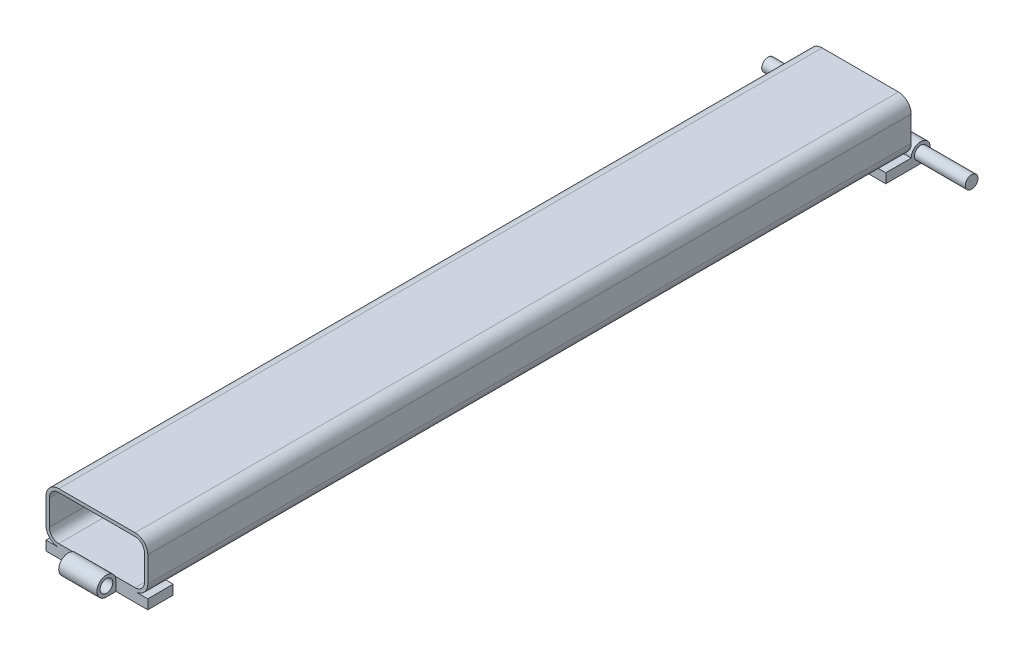
ISO-10303-21;
HEADER;
FILE_DESCRIPTION(('STEP AP214'),'2;1');
FILE_NAME('part.step','',(''),(''),'','','');
FILE_SCHEMA(('AUTOMOTIVE_DESIGN { 1 0 10303 214 1 1 1 1 }'));
ENDSEC;
DATA;
#1=APPLICATION_CONTEXT('core data for automotive mechanical design processes');
#2=APPLICATION_PROTOCOL_DEFINITION('international standard','automotive_design',2000,#1);
#3=PRODUCT_CONTEXT('',#1,'mechanical');
#4=PRODUCT('Part','Part','',(#3));
#5=PRODUCT_RELATED_PRODUCT_CATEGORY('part','',(#4));
#6=PRODUCT_DEFINITION_FORMATION('','',#4);
#7=PRODUCT_DEFINITION_CONTEXT('part definition',#1,'design');
#8=PRODUCT_DEFINITION('design','',#6,#7);
#9=PRODUCT_DEFINITION_SHAPE('','',#8);
#10=(LENGTH_UNIT() NAMED_UNIT(*) SI_UNIT(.MILLI.,.METRE.));
#11=(NAMED_UNIT(*) PLANE_ANGLE_UNIT() SI_UNIT($,.RADIAN.));
#12=(NAMED_UNIT(*) SI_UNIT($,.STERADIAN.) SOLID_ANGLE_UNIT());
#13=UNCERTAINTY_MEASURE_WITH_UNIT(LENGTH_MEASURE(1.E-05),#10,'distance_accuracy_value','');
#14=(GEOMETRIC_REPRESENTATION_CONTEXT(3) GLOBAL_UNCERTAINTY_ASSIGNED_CONTEXT((#13)) GLOBAL_UNIT_ASSIGNED_CONTEXT((#10,
#11,#12)) REPRESENTATION_CONTEXT('',''));
#15=CARTESIAN_POINT('',(0.,0.,0.));
#16=DIRECTION('',(0.,0.,1.));
#17=DIRECTION('',(1.,0.,0.));
#18=AXIS2_PLACEMENT_3D('',#15,#16,#17);
#19=CARTESIAN_POINT('',(-19.05,-12.7,190.5));
#20=DIRECTION('',(0.,1.,0.));
#21=DIRECTION('',(0.,0.,1.));
#22=AXIS2_PLACEMENT_3D('',#19,#20,#21);
#23=PLANE('',#22);
#24=DIRECTION('',(1.,0.,0.));
#25=VECTOR('',#24,1.);
#26=CARTESIAN_POINT('',(-25.4,-12.7,177.8));
#27=LINE('',#26,#25);
#28=CARTESIAN_POINT('',(-19.05,-12.7,177.8));
#29=VERTEX_POINT('',#28);
#30=CARTESIAN_POINT('',(19.05,-12.7,177.8));
#31=VERTEX_POINT('',#30);
#32=EDGE_CURVE('E57',#29,#31,#27,.T.);
#33=ORIENTED_EDGE('',*,*,#32,.F.);
#34=DIRECTION('',(0.,0.,-1.));
#35=VECTOR('',#34,1.);
#36=CARTESIAN_POINT('',(-19.05,-12.7,190.5));
#37=LINE('',#36,#35);
#38=CARTESIAN_POINT('',(-19.05,-12.7,-177.8));
#39=VERTEX_POINT('',#38);
#40=EDGE_CURVE('E430',#29,#39,#37,.T.);
#41=ORIENTED_EDGE('',*,*,#40,.T.);
#42=DIRECTION('',(1.,0.,0.));
#43=VECTOR('',#42,1.);
#44=CARTESIAN_POINT('',(-25.4,-12.7,-177.8));
#45=LINE('',#44,#43);
#46=CARTESIAN_POINT('',(19.05,-12.7,-177.8));
#47=VERTEX_POINT('',#46);
#48=EDGE_CURVE('E313',#39,#47,#45,.T.);
#49=ORIENTED_EDGE('',*,*,#48,.T.);
#50=DIRECTION('',(0.,0.,-1.));
#51=VECTOR('',#50,1.);
#52=CARTESIAN_POINT('',(19.05,-12.7,190.5));
#53=LINE('',#52,#51);
#54=EDGE_CURVE('E431',#31,#47,#53,.T.);
#55=ORIENTED_EDGE('',*,*,#54,.F.);
#56=EDGE_LOOP('',(#33,#41,#49,#55));
#57=FACE_BOUND('',#56,.T.);
#58=ADVANCED_FACE('F33',(#57),#23,.F.);
#59=CARTESIAN_POINT('',(-19.05,-6.35,190.5));
#60=DIRECTION('',(0.,0.,-1.));
#61=DIRECTION('',(-1.,0.,0.));
#62=AXIS2_PLACEMENT_3D('',#59,#60,#61);
#63=PLANE('',#62);
#64=CARTESIAN_POINT('',(-19.05,6.35,190.5));
#65=DIRECTION('',(0.,0.,1.));
#66=DIRECTION('',(-1.,0.,0.));
#67=AXIS2_PLACEMENT_3D('',#64,#65,#66);
#68=CIRCLE('',#67,4.699);
#69=CARTESIAN_POINT('',(-19.05,11.049,190.5));
#70=VERTEX_POINT('',#69);
#71=CARTESIAN_POINT('',(-23.749,6.35,190.5));
#72=VERTEX_POINT('',#71);
#73=EDGE_CURVE('E316',#70,#72,#68,.T.);
#74=ORIENTED_EDGE('',*,*,#73,.F.);
#75=DIRECTION('',(-1.,0.,0.));
#76=VECTOR('',#75,1.);
#77=CARTESIAN_POINT('',(-19.05,11.049,190.5));
#78=LINE('',#77,#76);
#79=CARTESIAN_POINT('',(19.05,11.049,190.5));
#80=VERTEX_POINT('',#79);
#81=EDGE_CURVE('E332',#80,#70,#78,.T.);
#82=ORIENTED_EDGE('',*,*,#81,.F.);
#83=CARTESIAN_POINT('',(19.05,6.35,190.5));
#84=DIRECTION('',(0.,0.,1.));
#85=DIRECTION('',(-1.,0.,0.));
#86=AXIS2_PLACEMENT_3D('',#83,#84,#85);
#87=CIRCLE('',#86,4.699);
#88=CARTESIAN_POINT('',(23.749,6.35,190.5));
#89=VERTEX_POINT('',#88);
#90=EDGE_CURVE('E329',#89,#80,#87,.T.);
#91=ORIENTED_EDGE('',*,*,#90,.F.);
#92=DIRECTION('',(0.,1.,0.));
#93=VECTOR('',#92,1.);
#94=CARTESIAN_POINT('',(23.749,-6.35,190.5));
#95=LINE('',#94,#93);
#96=CARTESIAN_POINT('',(23.749,-6.35,190.5));
#97=VERTEX_POINT('',#96);
#98=EDGE_CURVE('E327',#97,#89,#95,.T.);
#99=ORIENTED_EDGE('',*,*,#98,.F.);
#100=CARTESIAN_POINT('',(19.05,-6.35,190.5));
#101=DIRECTION('',(0.,0.,1.));
#102=DIRECTION('',(1.,0.,0.));
#103=AXIS2_PLACEMENT_3D('',#100,#101,#102);
#104=CIRCLE('',#103,4.699);
#105=CARTESIAN_POINT('',(19.05,-11.049,190.5));
#106=VERTEX_POINT('',#105);
#107=EDGE_CURVE('E325',#106,#97,#104,.T.);
#108=ORIENTED_EDGE('',*,*,#107,.F.);
#109=DIRECTION('',(1.,0.,0.));
#110=VECTOR('',#109,1.);
#111=CARTESIAN_POINT('',(-19.05,-11.049,190.5));
#112=LINE('',#111,#110);
#113=CARTESIAN_POINT('',(-19.05,-11.049,190.5));
#114=VERTEX_POINT('',#113);
#115=EDGE_CURVE('E323',#114,#106,#112,.T.);
#116=ORIENTED_EDGE('',*,*,#115,.F.);
#117=CARTESIAN_POINT('',(-19.05,-6.35,190.5));
#118=DIRECTION('',(0.,0.,1.));
#119=DIRECTION('',(-1.,0.,0.));
#120=AXIS2_PLACEMENT_3D('',#117,#118,#119);
#121=CIRCLE('',#120,4.699);
#122=CARTESIAN_POINT('',(-23.749,-6.35,190.5));
#123=VERTEX_POINT('',#122);
#124=EDGE_CURVE('E321',#123,#114,#121,.T.);
#125=ORIENTED_EDGE('',*,*,#124,.F.);
#126=DIRECTION('',(0.,-1.,0.));
#127=VECTOR('',#126,1.);
#128=CARTESIAN_POINT('',(-23.749,-6.35,190.5));
#129=LINE('',#128,#127);
#130=EDGE_CURVE('E318',#72,#123,#129,.T.);
#131=ORIENTED_EDGE('',*,*,#130,.F.);
#132=EDGE_LOOP('',(#74,#82,#91,#99,#108,#116,#125,#131));
#133=FACE_BOUND('',#132,.T.);
#134=DIRECTION('',(-1.,0.,0.));
#135=VECTOR('',#134,1.);
#136=CARTESIAN_POINT('',(-19.05,12.7,190.5));
#137=LINE('',#136,#135);
#138=CARTESIAN_POINT('',(19.05,12.7,190.5));
#139=VERTEX_POINT('',#138);
#140=CARTESIAN_POINT('',(-19.05,12.7,190.5));
#141=VERTEX_POINT('',#140);
#142=EDGE_CURVE('E387',#139,#141,#137,.T.);
#143=ORIENTED_EDGE('',*,*,#142,.T.);
#144=CARTESIAN_POINT('',(-19.05,6.35,190.5));
#145=DIRECTION('',(0.,0.,1.));
#146=DIRECTION('',(-1.,0.,0.));
#147=AXIS2_PLACEMENT_3D('',#144,#145,#146);
#148=CIRCLE('',#147,6.35);
#149=CARTESIAN_POINT('',(-25.4,6.35,190.5));
#150=VERTEX_POINT('',#149);
#151=EDGE_CURVE('E389',#141,#150,#148,.T.);
#152=ORIENTED_EDGE('',*,*,#151,.T.);
#153=DIRECTION('',(0.,-1.,0.));
#154=VECTOR('',#153,1.);
#155=CARTESIAN_POINT('',(-25.4,-6.35,190.5));
#156=LINE('',#155,#154);
#157=CARTESIAN_POINT('',(-25.4,-6.35,190.5));
#158=VERTEX_POINT('',#157);
#159=EDGE_CURVE('E391',#150,#158,#156,.T.);
#160=ORIENTED_EDGE('',*,*,#159,.T.);
#161=CARTESIAN_POINT('',(-19.05,-6.35,190.5));
#162=DIRECTION('',(0.,0.,1.));
#163=DIRECTION('',(-1.,0.,0.));
#164=AXIS2_PLACEMENT_3D('',#161,#162,#163);
#165=CIRCLE('',#164,6.35);
#166=CARTESIAN_POINT('',(-19.05,-12.7,190.5));
#167=VERTEX_POINT('',#166);
#168=EDGE_CURVE('E375',#158,#167,#165,.T.);
#169=ORIENTED_EDGE('',*,*,#168,.T.);
#170=DIRECTION('',(1.,0.,0.));
#171=VECTOR('',#170,1.);
#172=CARTESIAN_POINT('',(-25.4,-12.7,190.5));
#173=LINE('',#172,#171);
#174=CARTESIAN_POINT('',(-25.4,-12.7,190.5));
#175=VERTEX_POINT('',#174);
#176=EDGE_CURVE('E232',#175,#167,#173,.T.);
#177=ORIENTED_EDGE('',*,*,#176,.F.);
#178=DIRECTION('',(0.,1.,0.));
#179=VECTOR('',#178,1.);
#180=CARTESIAN_POINT('',(-25.4,-12.7,190.5));
#181=LINE('',#180,#179);
#182=CARTESIAN_POINT('',(-25.4,-17.4625000000001,190.5));
#183=VERTEX_POINT('',#182);
#184=EDGE_CURVE('E225',#183,#175,#181,.T.);
#185=ORIENTED_EDGE('',*,*,#184,.F.);
#186=DIRECTION('',(1.,0.,0.));
#187=VECTOR('',#186,1.);
#188=CARTESIAN_POINT('',(-9.525,-17.4625000000001,190.5));
#189=LINE('',#188,#187);
#190=CARTESIAN_POINT('',(-9.525,-17.4625000000001,190.5));
#191=VERTEX_POINT('',#190);
#192=EDGE_CURVE('E229',#183,#191,#189,.T.);
#193=ORIENTED_EDGE('',*,*,#192,.T.);
#194=DIRECTION('',(0.,-1.,0.));
#195=VECTOR('',#194,1.);
#196=CARTESIAN_POINT('',(-9.525,12.7,190.5));
#197=LINE('',#196,#195);
#198=CARTESIAN_POINT('',(-9.525,-12.7,190.5));
#199=VERTEX_POINT('',#198);
#200=EDGE_CURVE('E449',#199,#191,#197,.T.);
#201=ORIENTED_EDGE('',*,*,#200,.F.);
#202=DIRECTION('',(1.,0.,0.));
#203=VECTOR('',#202,1.);
#204=CARTESIAN_POINT('',(-19.05,-12.7,190.5));
#205=LINE('',#204,#203);
#206=CARTESIAN_POINT('',(9.525,-12.7,190.5));
#207=VERTEX_POINT('',#206);
#208=EDGE_CURVE('E377',#199,#207,#205,.T.);
#209=ORIENTED_EDGE('',*,*,#208,.T.);
#210=DIRECTION('',(0.,-1.,0.));
#211=VECTOR('',#210,1.);
#212=CARTESIAN_POINT('',(9.525,12.7,190.5));
#213=LINE('',#212,#211);
#214=CARTESIAN_POINT('',(9.525,-17.4625000000001,190.5));
#215=VERTEX_POINT('',#214);
#216=EDGE_CURVE('E246',#207,#215,#213,.T.);
#217=ORIENTED_EDGE('',*,*,#216,.T.);
#218=DIRECTION('',(1.,0.,0.));
#219=VECTOR('',#218,1.);
#220=CARTESIAN_POINT('',(25.4,-17.4625000000001,190.5));
#221=LINE('',#220,#219);
#222=CARTESIAN_POINT('',(25.4,-17.4625,190.5));
#223=VERTEX_POINT('',#222);
#224=EDGE_CURVE('E49',#215,#223,#221,.T.);
#225=ORIENTED_EDGE('',*,*,#224,.T.);
#226=DIRECTION('',(0.,1.,0.));
#227=VECTOR('',#226,1.);
#228=CARTESIAN_POINT('',(25.4,-12.7,190.5));
#229=LINE('',#228,#227);
#230=CARTESIAN_POINT('',(25.4,-12.7,190.5));
#231=VERTEX_POINT('',#230);
#232=EDGE_CURVE('E237',#223,#231,#229,.T.);
#233=ORIENTED_EDGE('',*,*,#232,.T.);
#234=CARTESIAN_POINT('',(19.05,-12.7,190.5));
#235=VERTEX_POINT('',#234);
#236=EDGE_CURVE('E253',#235,#231,#173,.T.);
#237=ORIENTED_EDGE('',*,*,#236,.F.);
#238=CARTESIAN_POINT('',(19.05,-6.35,190.5));
#239=DIRECTION('',(0.,0.,1.));
#240=DIRECTION('',(1.,0.,0.));
#241=AXIS2_PLACEMENT_3D('',#238,#239,#240);
#242=CIRCLE('',#241,6.35);
#243=CARTESIAN_POINT('',(25.4,-6.35,190.5));
#244=VERTEX_POINT('',#243);
#245=EDGE_CURVE('E381',#235,#244,#242,.T.);
#246=ORIENTED_EDGE('',*,*,#245,.T.);
#247=DIRECTION('',(0.,1.,0.));
#248=VECTOR('',#247,1.);
#249=CARTESIAN_POINT('',(25.4,-6.35,190.5));
#250=LINE('',#249,#248);
#251=CARTESIAN_POINT('',(25.4,6.35,190.5));
#252=VERTEX_POINT('',#251);
#253=EDGE_CURVE('E383',#244,#252,#250,.T.);
#254=ORIENTED_EDGE('',*,*,#253,.T.);
#255=CARTESIAN_POINT('',(19.05,6.35,190.5));
#256=DIRECTION('',(0.,0.,1.));
#257=DIRECTION('',(-1.,0.,0.));
#258=AXIS2_PLACEMENT_3D('',#255,#256,#257);
#259=CIRCLE('',#258,6.35);
#260=EDGE_CURVE('E385',#252,#139,#259,.T.);
#261=ORIENTED_EDGE('',*,*,#260,.T.);
#262=EDGE_LOOP('',(#143,#152,#160,#169,#177,#185,#193,#201,#209,#217,#225,#233,#237,#246,#254,#261));
#263=FACE_BOUND('',#262,.T.);
#264=ADVANCED_FACE('F227',(#133,#263),#63,.F.);
#265=CARTESIAN_POINT('',(-19.05,-6.35,-190.5));
#266=DIRECTION('',(0.,0.,-1.));
#267=DIRECTION('',(-1.,0.,0.));
#268=AXIS2_PLACEMENT_3D('',#265,#266,#267);
#269=PLANE('',#268);
#270=CARTESIAN_POINT('',(-19.05,-6.35,-190.5));
#271=DIRECTION('',(0.,0.,1.));
#272=DIRECTION('',(-1.,0.,0.));
#273=AXIS2_PLACEMENT_3D('',#270,#271,#272);
#274=CIRCLE('',#273,6.35);
#275=CARTESIAN_POINT('',(-25.4,-6.35,-190.5));
#276=VERTEX_POINT('',#275);
#277=CARTESIAN_POINT('',(-19.05,-12.7,-190.5));
#278=VERTEX_POINT('',#277);
#279=EDGE_CURVE('E374',#276,#278,#274,.T.);
#280=ORIENTED_EDGE('',*,*,#279,.F.);
#281=DIRECTION('',(0.,-1.,0.));
#282=VECTOR('',#281,1.);
#283=CARTESIAN_POINT('',(-25.4,-6.35,-190.5));
#284=LINE('',#283,#282);
#285=CARTESIAN_POINT('',(-25.4,6.35,-190.5));
#286=VERTEX_POINT('',#285);
#287=EDGE_CURVE('E378',#286,#276,#284,.T.);
#288=ORIENTED_EDGE('',*,*,#287,.F.);
#289=CARTESIAN_POINT('',(-19.05,6.35,-190.5));
#290=DIRECTION('',(0.,0.,1.));
#291=DIRECTION('',(-1.,0.,0.));
#292=AXIS2_PLACEMENT_3D('',#289,#290,#291);
#293=CIRCLE('',#292,6.35);
#294=CARTESIAN_POINT('',(-19.05,12.7,-190.5));
#295=VERTEX_POINT('',#294);
#296=EDGE_CURVE('E406',#295,#286,#293,.T.);
#297=ORIENTED_EDGE('',*,*,#296,.F.);
#298=DIRECTION('',(-1.,0.,0.));
#299=VECTOR('',#298,1.);
#300=CARTESIAN_POINT('',(-19.05,12.7,-190.5));
#301=LINE('',#300,#299);
#302=CARTESIAN_POINT('',(19.05,12.7,-190.5));
#303=VERTEX_POINT('',#302);
#304=EDGE_CURVE('E404',#303,#295,#301,.T.);
#305=ORIENTED_EDGE('',*,*,#304,.F.);
#306=CARTESIAN_POINT('',(19.05,6.35,-190.5));
#307=DIRECTION('',(0.,0.,1.));
#308=DIRECTION('',(-1.,0.,0.));
#309=AXIS2_PLACEMENT_3D('',#306,#307,#308);
#310=CIRCLE('',#309,6.35);
#311=CARTESIAN_POINT('',(25.4,6.35,-190.5));
#312=VERTEX_POINT('',#311);
#313=EDGE_CURVE('E402',#312,#303,#310,.T.);
#314=ORIENTED_EDGE('',*,*,#313,.F.);
#315=DIRECTION('',(0.,1.,0.));
#316=VECTOR('',#315,1.);
#317=CARTESIAN_POINT('',(25.4,-6.35,-190.5));
#318=LINE('',#317,#316);
#319=CARTESIAN_POINT('',(25.4,-6.35,-190.5));
#320=VERTEX_POINT('',#319);
#321=EDGE_CURVE('E400',#320,#312,#318,.T.);
#322=ORIENTED_EDGE('',*,*,#321,.F.);
#323=CARTESIAN_POINT('',(19.05,-6.35,-190.5));
#324=DIRECTION('',(0.,0.,1.));
#325=DIRECTION('',(1.,0.,0.));
#326=AXIS2_PLACEMENT_3D('',#323,#324,#325);
#327=CIRCLE('',#326,6.35);
#328=CARTESIAN_POINT('',(19.05,-12.7,-190.5));
#329=VERTEX_POINT('',#328);
#330=EDGE_CURVE('E398',#329,#320,#327,.T.);
#331=ORIENTED_EDGE('',*,*,#330,.F.);
#332=DIRECTION('',(1.,0.,0.));
#333=VECTOR('',#332,1.);
#334=CARTESIAN_POINT('',(-19.05,-12.7,-190.5));
#335=LINE('',#334,#333);
#336=EDGE_CURVE('E396',#278,#329,#335,.T.);
#337=ORIENTED_EDGE('',*,*,#336,.F.);
#338=EDGE_LOOP('',(#280,#288,#297,#305,#314,#322,#331,#337));
#339=FACE_BOUND('',#338,.T.);
#340=DIRECTION('',(-1.,0.,0.));
#341=VECTOR('',#340,1.);
#342=CARTESIAN_POINT('',(-19.05,11.049,-190.5));
#343=LINE('',#342,#341);
#344=CARTESIAN_POINT('',(19.05,11.049,-190.5));
#345=VERTEX_POINT('',#344);
#346=CARTESIAN_POINT('',(-19.05,11.049,-190.5));
#347=VERTEX_POINT('',#346);
#348=EDGE_CURVE('E319',#345,#347,#343,.T.);
#349=ORIENTED_EDGE('',*,*,#348,.T.);
#350=CARTESIAN_POINT('',(-19.05,6.35,-190.5));
#351=DIRECTION('',(0.,0.,1.));
#352=DIRECTION('',(-1.,0.,0.));
#353=AXIS2_PLACEMENT_3D('',#350,#351,#352);
#354=CIRCLE('',#353,4.699);
#355=CARTESIAN_POINT('',(-23.749,6.35,-190.5));
#356=VERTEX_POINT('',#355);
#357=EDGE_CURVE('E315',#347,#356,#354,.T.);
#358=ORIENTED_EDGE('',*,*,#357,.T.);
#359=DIRECTION('',(0.,-1.,0.));
#360=VECTOR('',#359,1.);
#361=CARTESIAN_POINT('',(-23.749,-6.35,-190.5));
#362=LINE('',#361,#360);
#363=CARTESIAN_POINT('',(-23.749,-6.35,-190.5));
#364=VERTEX_POINT('',#363);
#365=EDGE_CURVE('E337',#356,#364,#362,.T.);
#366=ORIENTED_EDGE('',*,*,#365,.T.);
#367=CARTESIAN_POINT('',(-19.05,-6.35,-190.5));
#368=DIRECTION('',(0.,0.,1.));
#369=DIRECTION('',(-1.,0.,0.));
#370=AXIS2_PLACEMENT_3D('',#367,#368,#369);
#371=CIRCLE('',#370,4.699);
#372=CARTESIAN_POINT('',(-19.05,-11.049,-190.5));
#373=VERTEX_POINT('',#372);
#374=EDGE_CURVE('E340',#364,#373,#371,.T.);
#375=ORIENTED_EDGE('',*,*,#374,.T.);
#376=DIRECTION('',(1.,0.,0.));
#377=VECTOR('',#376,1.);
#378=CARTESIAN_POINT('',(-19.05,-11.049,-190.5));
#379=LINE('',#378,#377);
#380=CARTESIAN_POINT('',(19.05,-11.049,-190.5));
#381=VERTEX_POINT('',#380);
#382=EDGE_CURVE('E343',#373,#381,#379,.T.);
#383=ORIENTED_EDGE('',*,*,#382,.T.);
#384=CARTESIAN_POINT('',(19.05,-6.35,-190.5));
#385=DIRECTION('',(0.,0.,1.));
#386=DIRECTION('',(1.,0.,0.));
#387=AXIS2_PLACEMENT_3D('',#384,#385,#386);
#388=CIRCLE('',#387,4.699);
#389=CARTESIAN_POINT('',(23.749,-6.35,-190.5));
#390=VERTEX_POINT('',#389);
#391=EDGE_CURVE('E346',#381,#390,#388,.T.);
#392=ORIENTED_EDGE('',*,*,#391,.T.);
#393=DIRECTION('',(0.,1.,0.));
#394=VECTOR('',#393,1.);
#395=CARTESIAN_POINT('',(23.749,-6.35,-190.5));
#396=LINE('',#395,#394);
#397=CARTESIAN_POINT('',(23.749,6.35,-190.5));
#398=VERTEX_POINT('',#397);
#399=EDGE_CURVE('E349',#390,#398,#396,.T.);
#400=ORIENTED_EDGE('',*,*,#399,.T.);
#401=CARTESIAN_POINT('',(19.05,6.35,-190.5));
#402=DIRECTION('',(0.,0.,1.));
#403=DIRECTION('',(-1.,0.,0.));
#404=AXIS2_PLACEMENT_3D('',#401,#402,#403);
#405=CIRCLE('',#404,4.699);
#406=EDGE_CURVE('E352',#398,#345,#405,.T.);
#407=ORIENTED_EDGE('',*,*,#406,.T.);
#408=EDGE_LOOP('',(#349,#358,#366,#375,#383,#392,#400,#407));
#409=FACE_BOUND('',#408,.T.);
#410=ADVANCED_FACE('F498',(#339,#409),#269,.T.);
#411=CARTESIAN_POINT('',(-19.05,-6.35,190.5));
#412=DIRECTION('',(0.,0.,-1.));
#413=DIRECTION('',(-1.,0.,0.));
#414=AXIS2_PLACEMENT_3D('',#411,#412,#413);
#415=CYLINDRICAL_SURFACE('',#414,6.35);
#416=ORIENTED_EDGE('',*,*,#279,.T.);
#417=DIRECTION('',(0.,0.,-1.));
#418=VECTOR('',#417,1.);
#419=CARTESIAN_POINT('',(-19.05,-12.7,190.5));
#420=LINE('',#419,#418);
#421=EDGE_CURVE('E304',#39,#278,#420,.T.);
#422=ORIENTED_EDGE('',*,*,#421,.F.);
#423=ORIENTED_EDGE('',*,*,#40,.F.);
#424=EDGE_CURVE('E432',#167,#29,#37,.T.);
#425=ORIENTED_EDGE('',*,*,#424,.F.);
#426=ORIENTED_EDGE('',*,*,#168,.F.);
#427=DIRECTION('',(0.,0.,-1.));
#428=VECTOR('',#427,1.);
#429=CARTESIAN_POINT('',(-25.4,-6.35,190.5));
#430=LINE('',#429,#428);
#431=EDGE_CURVE('E393',#158,#276,#430,.T.);
#432=ORIENTED_EDGE('',*,*,#431,.T.);
#433=EDGE_LOOP('',(#416,#422,#423,#425,#426,#432));
#434=FACE_BOUND('',#433,.T.);
#435=ADVANCED_FACE('F35',(#434),#415,.T.);
#436=CARTESIAN_POINT('',(19.05,-6.35,190.5));
#437=DIRECTION('',(0.,0.,-1.));
#438=DIRECTION('',(-1.,0.,0.));
#439=AXIS2_PLACEMENT_3D('',#436,#437,#438);
#440=CYLINDRICAL_SURFACE('',#439,6.35);
#441=ORIENTED_EDGE('',*,*,#330,.T.);
#442=DIRECTION('',(0.,0.,-1.));
#443=VECTOR('',#442,1.);
#444=CARTESIAN_POINT('',(25.4,-6.35,190.5));
#445=LINE('',#444,#443);
#446=EDGE_CURVE('E423',#244,#320,#445,.T.);
#447=ORIENTED_EDGE('',*,*,#446,.F.);
#448=ORIENTED_EDGE('',*,*,#245,.F.);
#449=EDGE_CURVE('E427',#235,#31,#53,.T.);
#450=ORIENTED_EDGE('',*,*,#449,.T.);
#451=ORIENTED_EDGE('',*,*,#54,.T.);
#452=EDGE_CURVE('E426',#47,#329,#53,.T.);
#453=ORIENTED_EDGE('',*,*,#452,.T.);
#454=EDGE_LOOP('',(#441,#447,#448,#450,#451,#453));
#455=FACE_BOUND('',#454,.T.);
#456=ADVANCED_FACE('F510',(#455),#440,.T.);
#457=CARTESIAN_POINT('',(25.4,-6.35,190.5));
#458=DIRECTION('',(-1.,0.,0.));
#459=DIRECTION('',(0.,0.,1.));
#460=AXIS2_PLACEMENT_3D('',#457,#458,#459);
#461=PLANE('',#460);
#462=ORIENTED_EDGE('',*,*,#321,.T.);
#463=DIRECTION('',(0.,0.,-1.));
#464=VECTOR('',#463,1.);
#465=CARTESIAN_POINT('',(25.4,6.35,190.5));
#466=LINE('',#465,#464);
#467=EDGE_CURVE('E420',#252,#312,#466,.T.);
#468=ORIENTED_EDGE('',*,*,#467,.F.);
#469=ORIENTED_EDGE('',*,*,#253,.F.);
#470=ORIENTED_EDGE('',*,*,#446,.T.);
#471=EDGE_LOOP('',(#462,#468,#469,#470));
#472=FACE_BOUND('',#471,.T.);
#473=ADVANCED_FACE('F537',(#472),#461,.F.);
#474=CARTESIAN_POINT('',(19.05,6.35,190.5));
#475=DIRECTION('',(0.,0.,-1.));
#476=DIRECTION('',(-1.,0.,0.));
#477=AXIS2_PLACEMENT_3D('',#474,#475,#476);
#478=CYLINDRICAL_SURFACE('',#477,6.35);
#479=ORIENTED_EDGE('',*,*,#313,.T.);
#480=DIRECTION('',(0.,0.,-1.));
#481=VECTOR('',#480,1.);
#482=CARTESIAN_POINT('',(19.05,12.7,190.5));
#483=LINE('',#482,#481);
#484=EDGE_CURVE('E417',#139,#303,#483,.T.);
#485=ORIENTED_EDGE('',*,*,#484,.F.);
#486=ORIENTED_EDGE('',*,*,#260,.F.);
#487=ORIENTED_EDGE('',*,*,#467,.T.);
#488=EDGE_LOOP('',(#479,#485,#486,#487));
#489=FACE_BOUND('',#488,.T.);
#490=ADVANCED_FACE('F540',(#489),#478,.T.);
#491=CARTESIAN_POINT('',(-19.05,12.7,190.5));
#492=DIRECTION('',(0.,-1.,0.));
#493=DIRECTION('',(0.,0.,-1.));
#494=AXIS2_PLACEMENT_3D('',#491,#492,#493);
#495=PLANE('',#494);
#496=ORIENTED_EDGE('',*,*,#304,.T.);
#497=DIRECTION('',(0.,0.,-1.));
#498=VECTOR('',#497,1.);
#499=CARTESIAN_POINT('',(-19.05,12.7,190.5));
#500=LINE('',#499,#498);
#501=EDGE_CURVE('E414',#141,#295,#500,.T.);
#502=ORIENTED_EDGE('',*,*,#501,.F.);
#503=ORIENTED_EDGE('',*,*,#142,.F.);
#504=ORIENTED_EDGE('',*,*,#484,.T.);
#505=EDGE_LOOP('',(#496,#502,#503,#504));
#506=FACE_BOUND('',#505,.T.);
#507=ADVANCED_FACE('F544',(#506),#495,.F.);
#508=CARTESIAN_POINT('',(-19.05,6.35,190.5));
#509=DIRECTION('',(0.,0.,-1.));
#510=DIRECTION('',(-1.,0.,0.));
#511=AXIS2_PLACEMENT_3D('',#508,#509,#510);
#512=CYLINDRICAL_SURFACE('',#511,6.35);
#513=ORIENTED_EDGE('',*,*,#296,.T.);
#514=DIRECTION('',(0.,0.,-1.));
#515=VECTOR('',#514,1.);
#516=CARTESIAN_POINT('',(-25.4,6.35,190.5));
#517=LINE('',#516,#515);
#518=EDGE_CURVE('E411',#150,#286,#517,.T.);
#519=ORIENTED_EDGE('',*,*,#518,.F.);
#520=ORIENTED_EDGE('',*,*,#151,.F.);
#521=ORIENTED_EDGE('',*,*,#501,.T.);
#522=EDGE_LOOP('',(#513,#519,#520,#521));
#523=FACE_BOUND('',#522,.T.);
#524=ADVANCED_FACE('F548',(#523),#512,.T.);
#525=CARTESIAN_POINT('',(-25.4,-6.35,190.5));
#526=DIRECTION('',(1.,0.,0.));
#527=DIRECTION('',(0.,0.,-1.));
#528=AXIS2_PLACEMENT_3D('',#525,#526,#527);
#529=PLANE('',#528);
#530=ORIENTED_EDGE('',*,*,#287,.T.);
#531=ORIENTED_EDGE('',*,*,#431,.F.);
#532=ORIENTED_EDGE('',*,*,#159,.F.);
#533=ORIENTED_EDGE('',*,*,#518,.T.);
#534=EDGE_LOOP('',(#530,#531,#532,#533));
#535=FACE_BOUND('',#534,.T.);
#536=ADVANCED_FACE('F552',(#535),#529,.F.);
#537=CARTESIAN_POINT('',(-19.05,6.35,190.5));
#538=DIRECTION('',(0.,0.,-1.));
#539=DIRECTION('',(-1.,0.,0.));
#540=AXIS2_PLACEMENT_3D('',#537,#538,#539);
#541=CYLINDRICAL_SURFACE('',#540,4.699);
#542=ORIENTED_EDGE('',*,*,#357,.F.);
#543=DIRECTION('',(0.,0.,-1.));
#544=VECTOR('',#543,1.);
#545=CARTESIAN_POINT('',(-19.05,11.049,190.5));
#546=LINE('',#545,#544);
#547=EDGE_CURVE('E334',#70,#347,#546,.T.);
#548=ORIENTED_EDGE('',*,*,#547,.F.);
#549=ORIENTED_EDGE('',*,*,#73,.T.);
#550=DIRECTION('',(0.,0.,-1.));
#551=VECTOR('',#550,1.);
#552=CARTESIAN_POINT('',(-23.749,6.35,190.5));
#553=LINE('',#552,#551);
#554=EDGE_CURVE('E371',#72,#356,#553,.T.);
#555=ORIENTED_EDGE('',*,*,#554,.T.);
#556=EDGE_LOOP('',(#542,#548,#549,#555));
#557=FACE_BOUND('',#556,.T.);
#558=ADVANCED_FACE('F556',(#557),#541,.F.);
#559=CARTESIAN_POINT('',(-23.749,-6.35,190.5));
#560=DIRECTION('',(1.,0.,0.));
#561=DIRECTION('',(0.,0.,-1.));
#562=AXIS2_PLACEMENT_3D('',#559,#560,#561);
#563=PLANE('',#562);
#564=ORIENTED_EDGE('',*,*,#365,.F.);
#565=ORIENTED_EDGE('',*,*,#554,.F.);
#566=ORIENTED_EDGE('',*,*,#130,.T.);
#567=DIRECTION('',(0.,0.,-1.));
#568=VECTOR('',#567,1.);
#569=CARTESIAN_POINT('',(-23.749,-6.35,190.5));
#570=LINE('',#569,#568);
#571=EDGE_CURVE('E369',#123,#364,#570,.T.);
#572=ORIENTED_EDGE('',*,*,#571,.T.);
#573=EDGE_LOOP('',(#564,#565,#566,#572));
#574=FACE_BOUND('',#573,.T.);
#575=ADVANCED_FACE('F562',(#574),#563,.T.);
#576=CARTESIAN_POINT('',(-19.05,-6.35,190.5));
#577=DIRECTION('',(0.,0.,-1.));
#578=DIRECTION('',(-1.,0.,0.));
#579=AXIS2_PLACEMENT_3D('',#576,#577,#578);
#580=CYLINDRICAL_SURFACE('',#579,4.699);
#581=ORIENTED_EDGE('',*,*,#374,.F.);
#582=ORIENTED_EDGE('',*,*,#571,.F.);
#583=ORIENTED_EDGE('',*,*,#124,.T.);
#584=DIRECTION('',(0.,0.,-1.));
#585=VECTOR('',#584,1.);
#586=CARTESIAN_POINT('',(-19.05,-11.049,190.5));
#587=LINE('',#586,#585);
#588=EDGE_CURVE('E367',#114,#373,#587,.T.);
#589=ORIENTED_EDGE('',*,*,#588,.T.);
#590=EDGE_LOOP('',(#581,#582,#583,#589));
#591=FACE_BOUND('',#590,.T.);
#592=ADVANCED_FACE('F566',(#591),#580,.F.);
#593=CARTESIAN_POINT('',(-19.05,-11.049,190.5));
#594=DIRECTION('',(0.,1.,0.));
#595=DIRECTION('',(0.,0.,1.));
#596=AXIS2_PLACEMENT_3D('',#593,#594,#595);
#597=PLANE('',#596);
#598=ORIENTED_EDGE('',*,*,#382,.F.);
#599=ORIENTED_EDGE('',*,*,#588,.F.);
#600=ORIENTED_EDGE('',*,*,#115,.T.);
#601=DIRECTION('',(0.,0.,-1.));
#602=VECTOR('',#601,1.);
#603=CARTESIAN_POINT('',(19.05,-11.049,190.5));
#604=LINE('',#603,#602);
#605=EDGE_CURVE('E365',#106,#381,#604,.T.);
#606=ORIENTED_EDGE('',*,*,#605,.T.);
#607=EDGE_LOOP('',(#598,#599,#600,#606));
#608=FACE_BOUND('',#607,.T.);
#609=ADVANCED_FACE('F570',(#608),#597,.T.);
#610=CARTESIAN_POINT('',(19.05,-6.35,190.5));
#611=DIRECTION('',(0.,0.,-1.));
#612=DIRECTION('',(-1.,0.,0.));
#613=AXIS2_PLACEMENT_3D('',#610,#611,#612);
#614=CYLINDRICAL_SURFACE('',#613,4.699);
#615=ORIENTED_EDGE('',*,*,#391,.F.);
#616=ORIENTED_EDGE('',*,*,#605,.F.);
#617=ORIENTED_EDGE('',*,*,#107,.T.);
#618=DIRECTION('',(0.,0.,-1.));
#619=VECTOR('',#618,1.);
#620=CARTESIAN_POINT('',(23.749,-6.35,190.5));
#621=LINE('',#620,#619);
#622=EDGE_CURVE('E363',#97,#390,#621,.T.);
#623=ORIENTED_EDGE('',*,*,#622,.T.);
#624=EDGE_LOOP('',(#615,#616,#617,#623));
#625=FACE_BOUND('',#624,.T.);
#626=ADVANCED_FACE('F574',(#625),#614,.F.);
#627=CARTESIAN_POINT('',(23.749,-6.35,190.5));
#628=DIRECTION('',(-1.,0.,0.));
#629=DIRECTION('',(0.,-1.,0.));
#630=AXIS2_PLACEMENT_3D('',#627,#628,#629);
#631=PLANE('',#630);
#632=ORIENTED_EDGE('',*,*,#399,.F.);
#633=ORIENTED_EDGE('',*,*,#622,.F.);
#634=ORIENTED_EDGE('',*,*,#98,.T.);
#635=DIRECTION('',(0.,0.,-1.));
#636=VECTOR('',#635,1.);
#637=CARTESIAN_POINT('',(23.749,6.35,190.5));
#638=LINE('',#637,#636);
#639=EDGE_CURVE('E361',#89,#398,#638,.T.);
#640=ORIENTED_EDGE('',*,*,#639,.T.);
#641=EDGE_LOOP('',(#632,#633,#634,#640));
#642=FACE_BOUND('',#641,.T.);
#643=ADVANCED_FACE('F578',(#642),#631,.T.);
#644=CARTESIAN_POINT('',(19.05,6.35,190.5));
#645=DIRECTION('',(0.,0.,-1.));
#646=DIRECTION('',(-1.,0.,0.));
#647=AXIS2_PLACEMENT_3D('',#644,#645,#646);
#648=CYLINDRICAL_SURFACE('',#647,4.699);
#649=ORIENTED_EDGE('',*,*,#406,.F.);
#650=ORIENTED_EDGE('',*,*,#639,.F.);
#651=ORIENTED_EDGE('',*,*,#90,.T.);
#652=DIRECTION('',(0.,0.,-1.));
#653=VECTOR('',#652,1.);
#654=CARTESIAN_POINT('',(19.05,11.049,190.5));
#655=LINE('',#654,#653);
#656=EDGE_CURVE('E359',#80,#345,#655,.T.);
#657=ORIENTED_EDGE('',*,*,#656,.T.);
#658=EDGE_LOOP('',(#649,#650,#651,#657));
#659=FACE_BOUND('',#658,.T.);
#660=ADVANCED_FACE('F582',(#659),#648,.F.);
#661=CARTESIAN_POINT('',(-19.05,11.049,190.5));
#662=DIRECTION('',(0.,-1.,0.));
#663=DIRECTION('',(0.,0.,-1.));
#664=AXIS2_PLACEMENT_3D('',#661,#662,#663);
#665=PLANE('',#664);
#666=ORIENTED_EDGE('',*,*,#348,.F.);
#667=ORIENTED_EDGE('',*,*,#656,.F.);
#668=ORIENTED_EDGE('',*,*,#81,.T.);
#669=ORIENTED_EDGE('',*,*,#547,.T.);
#670=EDGE_LOOP('',(#666,#667,#668,#669));
#671=FACE_BOUND('',#670,.T.);
#672=ADVANCED_FACE('F586',(#671),#665,.T.);
#673=CARTESIAN_POINT('',(-25.4,-12.7,-190.5));
#674=DIRECTION('',(0.,1.,0.));
#675=DIRECTION('',(0.,0.,1.));
#676=AXIS2_PLACEMENT_3D('',#673,#674,#675);
#677=PLANE('',#676);
#678=ORIENTED_EDGE('',*,*,#452,.F.);
#679=CARTESIAN_POINT('',(25.4,-12.7,-177.8));
#680=VERTEX_POINT('',#679);
#681=EDGE_CURVE('E290',#47,#680,#45,.T.);
#682=ORIENTED_EDGE('',*,*,#681,.T.);
#683=DIRECTION('',(0.,0.,1.));
#684=VECTOR('',#683,1.);
#685=CARTESIAN_POINT('',(25.4,-12.7,-190.5));
#686=LINE('',#685,#684);
#687=CARTESIAN_POINT('',(25.4,-12.7,-190.5));
#688=VERTEX_POINT('',#687);
#689=EDGE_CURVE('E269',#688,#680,#686,.T.);
#690=ORIENTED_EDGE('',*,*,#689,.F.);
#691=DIRECTION('',(1.,0.,0.));
#692=VECTOR('',#691,1.);
#693=CARTESIAN_POINT('',(-25.4,-12.7,-190.5));
#694=LINE('',#693,#692);
#695=EDGE_CURVE('E305',#329,#688,#694,.T.);
#696=ORIENTED_EDGE('',*,*,#695,.F.);
#697=EDGE_LOOP('',(#678,#682,#690,#696));
#698=FACE_BOUND('',#697,.T.);
#699=ADVANCED_FACE('F508',(#698),#677,.T.);
#700=CARTESIAN_POINT('',(-25.4,-12.7,-177.8));
#701=VERTEX_POINT('',#700);
#702=EDGE_CURVE('E310',#701,#39,#45,.T.);
#703=ORIENTED_EDGE('',*,*,#702,.T.);
#704=ORIENTED_EDGE('',*,*,#421,.T.);
#705=CARTESIAN_POINT('',(-25.4,-12.7,-190.5));
#706=VERTEX_POINT('',#705);
#707=EDGE_CURVE('E301',#706,#278,#694,.T.);
#708=ORIENTED_EDGE('',*,*,#707,.F.);
#709=DIRECTION('',(0.,0.,1.));
#710=VECTOR('',#709,1.);
#711=CARTESIAN_POINT('',(-25.4,-12.7,-190.5));
#712=LINE('',#711,#710);
#713=EDGE_CURVE('E277',#706,#701,#712,.T.);
#714=ORIENTED_EDGE('',*,*,#713,.T.);
#715=EDGE_LOOP('',(#703,#704,#708,#714));
#716=FACE_BOUND('',#715,.T.);
#717=ADVANCED_FACE('F489',(#716),#677,.T.);
#718=CARTESIAN_POINT('',(-25.4,-12.7,-195.2625));
#719=DIRECTION('',(1.,0.,0.));
#720=DIRECTION('',(0.,0.,-1.));
#721=AXIS2_PLACEMENT_3D('',#718,#719,#720);
#722=CYLINDRICAL_SURFACE('',#721,4.7625);
#723=CARTESIAN_POINT('',(25.4,-12.7,-195.2625));
#724=DIRECTION('',(1.,0.,0.));
#725=DIRECTION('',(0.,0.,-1.));
#726=AXIS2_PLACEMENT_3D('',#723,#724,#725);
#727=CIRCLE('',#726,4.7625);
#728=CARTESIAN_POINT('',(25.4,-17.4625,-195.2625));
#729=VERTEX_POINT('',#728);
#730=EDGE_CURVE('E281',#729,#688,#727,.T.);
#731=ORIENTED_EDGE('',*,*,#730,.F.);
#732=DIRECTION('',(1.,0.,0.));
#733=VECTOR('',#732,1.);
#734=CARTESIAN_POINT('',(-25.4,-17.4625,-195.2625));
#735=LINE('',#734,#733);
#736=CARTESIAN_POINT('',(-25.4,-17.4625,-195.2625));
#737=VERTEX_POINT('',#736);
#738=EDGE_CURVE('E306',#737,#729,#735,.T.);
#739=ORIENTED_EDGE('',*,*,#738,.F.);
#740=CARTESIAN_POINT('',(-25.4,-12.7,-195.2625));
#741=DIRECTION('',(1.,0.,0.));
#742=DIRECTION('',(0.,0.,-1.));
#743=AXIS2_PLACEMENT_3D('',#740,#741,#742);
#744=CIRCLE('',#743,4.7625);
#745=EDGE_CURVE('E287',#737,#706,#744,.T.);
#746=ORIENTED_EDGE('',*,*,#745,.T.);
#747=ORIENTED_EDGE('',*,*,#707,.T.);
#748=ORIENTED_EDGE('',*,*,#336,.T.);
#749=ORIENTED_EDGE('',*,*,#695,.T.);
#750=EDGE_LOOP('',(#731,#739,#746,#747,#748,#749));
#751=FACE_BOUND('',#750,.T.);
#752=ADVANCED_FACE('F478',(#751),#722,.T.);
#753=CARTESIAN_POINT('',(-25.4,-17.4625,-177.8));
#754=DIRECTION('',(0.,-1.,0.));
#755=DIRECTION('',(0.,0.,-1.));
#756=AXIS2_PLACEMENT_3D('',#753,#754,#755);
#757=PLANE('',#756);
#758=DIRECTION('',(0.,0.,-1.));
#759=VECTOR('',#758,1.);
#760=CARTESIAN_POINT('',(25.4,-17.4625,-177.8));
#761=LINE('',#760,#759);
#762=CARTESIAN_POINT('',(25.4,-17.4625,-177.8));
#763=VERTEX_POINT('',#762);
#764=EDGE_CURVE('E296',#763,#729,#761,.T.);
#765=ORIENTED_EDGE('',*,*,#764,.F.);
#766=DIRECTION('',(1.,0.,0.));
#767=VECTOR('',#766,1.);
#768=CARTESIAN_POINT('',(-25.4,-17.4625,-177.8));
#769=LINE('',#768,#767);
#770=CARTESIAN_POINT('',(-25.4,-17.4625,-177.8));
#771=VERTEX_POINT('',#770);
#772=EDGE_CURVE('E308',#771,#763,#769,.T.);
#773=ORIENTED_EDGE('',*,*,#772,.F.);
#774=DIRECTION('',(0.,0.,-1.));
#775=VECTOR('',#774,1.);
#776=CARTESIAN_POINT('',(-25.4,-17.4625,-177.8));
#777=LINE('',#776,#775);
#778=EDGE_CURVE('E284',#771,#737,#777,.T.);
#779=ORIENTED_EDGE('',*,*,#778,.T.);
#780=ORIENTED_EDGE('',*,*,#738,.T.);
#781=EDGE_LOOP('',(#765,#773,#779,#780));
#782=FACE_BOUND('',#781,.T.);
#783=ADVANCED_FACE('F482',(#782),#757,.T.);
#784=CARTESIAN_POINT('',(-25.4,-12.7,-177.8));
#785=DIRECTION('',(0.,0.,1.));
#786=DIRECTION('',(1.,0.,0.));
#787=AXIS2_PLACEMENT_3D('',#784,#785,#786);
#788=PLANE('',#787);
#789=DIRECTION('',(0.,-1.,0.));
#790=VECTOR('',#789,1.);
#791=CARTESIAN_POINT('',(25.4,-12.7,-177.8));
#792=LINE('',#791,#790);
#793=EDGE_CURVE('E293',#680,#763,#792,.T.);
#794=ORIENTED_EDGE('',*,*,#793,.F.);
#795=ORIENTED_EDGE('',*,*,#681,.F.);
#796=ORIENTED_EDGE('',*,*,#48,.F.);
#797=ORIENTED_EDGE('',*,*,#702,.F.);
#798=DIRECTION('',(0.,-1.,0.));
#799=VECTOR('',#798,1.);
#800=CARTESIAN_POINT('',(-25.4,-12.7,-177.8));
#801=LINE('',#800,#799);
#802=EDGE_CURVE('E280',#701,#771,#801,.T.);
#803=ORIENTED_EDGE('',*,*,#802,.T.);
#804=ORIENTED_EDGE('',*,*,#772,.T.);
#805=EDGE_LOOP('',(#794,#795,#796,#797,#803,#804));
#806=FACE_BOUND('',#805,.T.);
#807=ADVANCED_FACE('F469',(#806),#788,.T.);
#808=CARTESIAN_POINT('',(-25.4,-12.7,-195.2625));
#809=DIRECTION('',(1.,0.,0.));
#810=DIRECTION('',(0.,0.,-1.));
#811=AXIS2_PLACEMENT_3D('',#808,#809,#810);
#812=PLANE('',#811);
#813=CARTESIAN_POINT('',(-25.4,-12.7,-195.2625));
#814=DIRECTION('',(1.,0.,0.));
#815=DIRECTION('',(0.,0.,-1.));
#816=AXIS2_PLACEMENT_3D('',#813,#814,#815);
#817=CIRCLE('',#816,3.175);
#818=CARTESIAN_POINT('',(-25.4,-12.7,-198.4375));
#819=VERTEX_POINT('',#818);
#820=EDGE_CURVE('E434',#819,#819,#817,.F.);
#821=ORIENTED_EDGE('',*,*,#820,.F.);
#822=EDGE_LOOP('',(#821));
#823=FACE_BOUND('',#822,.T.);
#824=ORIENTED_EDGE('',*,*,#713,.F.);
#825=ORIENTED_EDGE('',*,*,#745,.F.);
#826=ORIENTED_EDGE('',*,*,#778,.F.);
#827=ORIENTED_EDGE('',*,*,#802,.F.);
#828=EDGE_LOOP('',(#824,#825,#826,#827));
#829=FACE_BOUND('',#828,.T.);
#830=ADVANCED_FACE('F465',(#823,#829),#812,.F.);
#831=CARTESIAN_POINT('',(25.4,-12.7,-195.2625));
#832=DIRECTION('',(1.,0.,0.));
#833=DIRECTION('',(0.,0.,-1.));
#834=AXIS2_PLACEMENT_3D('',#831,#832,#833);
#835=PLANE('',#834);
#836=CARTESIAN_POINT('',(25.4,-12.7,-195.2625));
#837=DIRECTION('',(1.,0.,0.));
#838=DIRECTION('',(0.,0.,-1.));
#839=AXIS2_PLACEMENT_3D('',#836,#837,#838);
#840=CIRCLE('',#839,3.175);
#841=CARTESIAN_POINT('',(25.4,-12.7,-198.4375));
#842=VERTEX_POINT('',#841);
#843=EDGE_CURVE('E263',#842,#842,#840,.F.);
#844=ORIENTED_EDGE('',*,*,#843,.T.);
#845=EDGE_LOOP('',(#844));
#846=FACE_BOUND('',#845,.T.);
#847=ORIENTED_EDGE('',*,*,#689,.T.);
#848=ORIENTED_EDGE('',*,*,#793,.T.);
#849=ORIENTED_EDGE('',*,*,#764,.T.);
#850=ORIENTED_EDGE('',*,*,#730,.T.);
#851=EDGE_LOOP('',(#847,#848,#849,#850));
#852=FACE_BOUND('',#851,.T.);
#853=ADVANCED_FACE('F468',(#846,#852),#835,.T.);
#854=CARTESIAN_POINT('',(-25.4,-12.7,190.5));
#855=DIRECTION('',(0.,-1.,0.));
#856=DIRECTION('',(0.,0.,-1.));
#857=AXIS2_PLACEMENT_3D('',#854,#855,#856);
#858=PLANE('',#857);
#859=ORIENTED_EDGE('',*,*,#176,.T.);
#860=ORIENTED_EDGE('',*,*,#424,.T.);
#861=CARTESIAN_POINT('',(-25.4,-12.7,177.8));
#862=VERTEX_POINT('',#861);
#863=EDGE_CURVE('E267',#862,#29,#27,.T.);
#864=ORIENTED_EDGE('',*,*,#863,.F.);
#865=DIRECTION('',(0.,0.,-1.));
#866=VECTOR('',#865,1.);
#867=CARTESIAN_POINT('',(-25.4,-12.7,190.5));
#868=LINE('',#867,#866);
#869=EDGE_CURVE('E251',#175,#862,#868,.T.);
#870=ORIENTED_EDGE('',*,*,#869,.F.);
#871=EDGE_LOOP('',(#859,#860,#864,#870));
#872=FACE_BOUND('',#871,.T.);
#873=ADVANCED_FACE('F518',(#872),#858,.F.);
#874=ORIENTED_EDGE('',*,*,#449,.F.);
#875=ORIENTED_EDGE('',*,*,#236,.T.);
#876=DIRECTION('',(0.,0.,-1.));
#877=VECTOR('',#876,1.);
#878=CARTESIAN_POINT('',(25.4,-12.7,190.5));
#879=LINE('',#878,#877);
#880=CARTESIAN_POINT('',(25.4,-12.7,177.8));
#881=VERTEX_POINT('',#880);
#882=EDGE_CURVE('E259',#231,#881,#879,.T.);
#883=ORIENTED_EDGE('',*,*,#882,.T.);
#884=EDGE_CURVE('E270',#31,#881,#27,.T.);
#885=ORIENTED_EDGE('',*,*,#884,.F.);
#886=EDGE_LOOP('',(#874,#875,#883,#885));
#887=FACE_BOUND('',#886,.T.);
#888=ADVANCED_FACE('F524',(#887),#858,.F.);
#889=CARTESIAN_POINT('',(-25.4,-12.7,177.8));
#890=DIRECTION('',(0.,0.,1.));
#891=DIRECTION('',(1.,0.,0.));
#892=AXIS2_PLACEMENT_3D('',#889,#890,#891);
#893=PLANE('',#892);
#894=DIRECTION('',(0.,-1.,0.));
#895=VECTOR('',#894,1.);
#896=CARTESIAN_POINT('',(25.4,-12.7,177.8));
#897=LINE('',#896,#895);
#898=CARTESIAN_POINT('',(25.4,-17.4625,177.8));
#899=VERTEX_POINT('',#898);
#900=EDGE_CURVE('E255',#881,#899,#897,.T.);
#901=ORIENTED_EDGE('',*,*,#900,.T.);
#902=DIRECTION('',(1.,0.,0.));
#903=VECTOR('',#902,1.);
#904=CARTESIAN_POINT('',(-25.4,-17.4625,177.8));
#905=LINE('',#904,#903);
#906=CARTESIAN_POINT('',(-25.4,-17.4625,177.8));
#907=VERTEX_POINT('',#906);
#908=EDGE_CURVE('E271',#907,#899,#905,.T.);
#909=ORIENTED_EDGE('',*,*,#908,.F.);
#910=DIRECTION('',(0.,-1.,0.));
#911=VECTOR('',#910,1.);
#912=CARTESIAN_POINT('',(-25.4,-12.7,177.8));
#913=LINE('',#912,#911);
#914=EDGE_CURVE('E249',#862,#907,#913,.T.);
#915=ORIENTED_EDGE('',*,*,#914,.F.);
#916=ORIENTED_EDGE('',*,*,#863,.T.);
#917=ORIENTED_EDGE('',*,*,#32,.T.);
#918=ORIENTED_EDGE('',*,*,#884,.T.);
#919=EDGE_LOOP('',(#901,#909,#915,#916,#917,#918));
#920=FACE_BOUND('',#919,.T.);
#921=ADVANCED_FACE('F620',(#920),#893,.F.);
#922=CARTESIAN_POINT('',(-25.4,-17.4625,177.8));
#923=DIRECTION('',(0.,1.,0.));
#924=DIRECTION('',(0.,0.,1.));
#925=AXIS2_PLACEMENT_3D('',#922,#923,#924);
#926=PLANE('',#925);
#927=DIRECTION('',(1.,0.,0.));
#928=VECTOR('',#927,1.);
#929=CARTESIAN_POINT('',(-25.4,-17.4625,195.2625));
#930=LINE('',#929,#928);
#931=CARTESIAN_POINT('',(-9.525,-17.4625000000001,195.2625));
#932=VERTEX_POINT('',#931);
#933=CARTESIAN_POINT('',(9.525,-17.4625000000001,195.2625));
#934=VERTEX_POINT('',#933);
#935=EDGE_CURVE('E273',#932,#934,#930,.T.);
#936=ORIENTED_EDGE('',*,*,#935,.F.);
#937=DIRECTION('',(0.,0.,1.));
#938=VECTOR('',#937,1.);
#939=CARTESIAN_POINT('',(-9.525,-17.4625000000001,200.025));
#940=LINE('',#939,#938);
#941=EDGE_CURVE('E245',#191,#932,#940,.T.);
#942=ORIENTED_EDGE('',*,*,#941,.F.);
#943=ORIENTED_EDGE('',*,*,#192,.F.);
#944=DIRECTION('',(0.,0.,1.));
#945=VECTOR('',#944,1.);
#946=CARTESIAN_POINT('',(-25.4,-17.4625,177.8));
#947=LINE('',#946,#945);
#948=EDGE_CURVE('E244',#907,#183,#947,.T.);
#949=ORIENTED_EDGE('',*,*,#948,.F.);
#950=ORIENTED_EDGE('',*,*,#908,.T.);
#951=DIRECTION('',(0.,0.,1.));
#952=VECTOR('',#951,1.);
#953=CARTESIAN_POINT('',(25.4,-17.4625,177.8));
#954=LINE('',#953,#952);
#955=EDGE_CURVE('E262',#899,#223,#954,.T.);
#956=ORIENTED_EDGE('',*,*,#955,.T.);
#957=ORIENTED_EDGE('',*,*,#224,.F.);
#958=DIRECTION('',(0.,0.,-1.));
#959=VECTOR('',#958,1.);
#960=CARTESIAN_POINT('',(9.525,-17.4625000000001,190.5));
#961=LINE('',#960,#959);
#962=EDGE_CURVE('E447',#934,#215,#961,.T.);
#963=ORIENTED_EDGE('',*,*,#962,.F.);
#964=EDGE_LOOP('',(#936,#942,#943,#949,#950,#956,#957,#963));
#965=FACE_BOUND('',#964,.T.);
#966=ADVANCED_FACE('F242',(#965),#926,.F.);
#967=CARTESIAN_POINT('',(-25.4,-12.7,195.2625));
#968=DIRECTION('',(1.,0.,0.));
#969=DIRECTION('',(0.,0.,-1.));
#970=AXIS2_PLACEMENT_3D('',#967,#968,#969);
#971=CYLINDRICAL_SURFACE('',#970,4.7625);
#972=ORIENTED_EDGE('',*,*,#208,.F.);
#973=CARTESIAN_POINT('',(-9.525,-12.7,195.2625));
#974=DIRECTION('',(1.,0.,0.));
#975=DIRECTION('',(0.,0.,-1.));
#976=AXIS2_PLACEMENT_3D('',#973,#974,#975);
#977=CIRCLE('',#976,4.7625);
#978=EDGE_CURVE('E11',#199,#932,#977,.T.);
#979=ORIENTED_EDGE('',*,*,#978,.T.);
#980=ORIENTED_EDGE('',*,*,#935,.T.);
#981=CARTESIAN_POINT('',(9.525,-12.7,195.2625));
#982=DIRECTION('',(-1.,0.,0.));
#983=DIRECTION('',(0.,0.,1.));
#984=AXIS2_PLACEMENT_3D('',#981,#982,#983);
#985=CIRCLE('',#984,4.7625);
#986=EDGE_CURVE('E42',#934,#207,#985,.T.);
#987=ORIENTED_EDGE('',*,*,#986,.T.);
#988=EDGE_LOOP('',(#972,#979,#980,#987));
#989=FACE_BOUND('',#988,.T.);
#990=ADVANCED_FACE('F442',(#989),#971,.T.);
#991=CARTESIAN_POINT('',(-25.4,-12.7,195.2625));
#992=DIRECTION('',(1.,0.,0.));
#993=DIRECTION('',(0.,0.,1.));
#994=AXIS2_PLACEMENT_3D('',#991,#992,#993);
#995=PLANE('',#994);
#996=ORIENTED_EDGE('',*,*,#948,.T.);
#997=ORIENTED_EDGE('',*,*,#184,.T.);
#998=ORIENTED_EDGE('',*,*,#869,.T.);
#999=ORIENTED_EDGE('',*,*,#914,.T.);
#1000=EDGE_LOOP('',(#996,#997,#998,#999));
#1001=FACE_BOUND('',#1000,.T.);
#1002=ADVANCED_FACE('F248',(#1001),#995,.F.);
#1003=CARTESIAN_POINT('',(25.4,-12.7,195.2625));
#1004=DIRECTION('',(1.,0.,0.));
#1005=DIRECTION('',(0.,0.,1.));
#1006=AXIS2_PLACEMENT_3D('',#1003,#1004,#1005);
#1007=PLANE('',#1006);
#1008=ORIENTED_EDGE('',*,*,#232,.F.);
#1009=ORIENTED_EDGE('',*,*,#955,.F.);
#1010=ORIENTED_EDGE('',*,*,#900,.F.);
#1011=ORIENTED_EDGE('',*,*,#882,.F.);
#1012=EDGE_LOOP('',(#1008,#1009,#1010,#1011));
#1013=FACE_BOUND('',#1012,.T.);
#1014=ADVANCED_FACE('F635',(#1013),#1007,.T.);
#1015=CARTESIAN_POINT('',(50.8,-12.7,-195.2625));
#1016=DIRECTION('',(1.,0.,0.));
#1017=DIRECTION('',(0.,0.,-1.));
#1018=AXIS2_PLACEMENT_3D('',#1015,#1016,#1017);
#1019=PLANE('',#1018);
#1020=CARTESIAN_POINT('',(50.8,-12.7,-195.2625));
#1021=DIRECTION('',(1.,0.,0.));
#1022=DIRECTION('',(0.,0.,-1.));
#1023=AXIS2_PLACEMENT_3D('',#1020,#1021,#1022);
#1024=CIRCLE('',#1023,3.175);
#1025=CARTESIAN_POINT('',(50.8,-12.7,-198.4375));
#1026=VERTEX_POINT('',#1025);
#1027=EDGE_CURVE('E437',#1026,#1026,#1024,.T.);
#1028=ORIENTED_EDGE('',*,*,#1027,.T.);
#1029=EDGE_LOOP('',(#1028));
#1030=FACE_BOUND('',#1029,.T.);
#1031=ADVANCED_FACE('F629',(#1030),#1019,.T.);
#1032=CARTESIAN_POINT('',(50.8,-12.7,-195.2625));
#1033=DIRECTION('',(-1.,0.,0.));
#1034=DIRECTION('',(0.,0.,1.));
#1035=AXIS2_PLACEMENT_3D('',#1032,#1033,#1034);
#1036=CYLINDRICAL_SURFACE('',#1035,3.175);
#1037=ORIENTED_EDGE('',*,*,#843,.F.);
#1038=EDGE_LOOP('',(#1037));
#1039=FACE_BOUND('',#1038,.T.);
#1040=ORIENTED_EDGE('',*,*,#1027,.F.);
#1041=EDGE_LOOP('',(#1040));
#1042=FACE_BOUND('',#1041,.T.);
#1043=ADVANCED_FACE('F634',(#1039,#1042),#1036,.T.);
#1044=CARTESIAN_POINT('',(-50.8,-12.7,-195.2625));
#1045=DIRECTION('',(1.,0.,0.));
#1046=DIRECTION('',(0.,0.,-1.));
#1047=AXIS2_PLACEMENT_3D('',#1044,#1045,#1046);
#1048=CIRCLE('',#1047,3.175);
#1049=CARTESIAN_POINT('',(-50.8,-12.7,-198.4375));
#1050=VERTEX_POINT('',#1049);
#1051=EDGE_CURVE('E451',#1050,#1050,#1048,.T.);
#1052=ORIENTED_EDGE('',*,*,#1051,.T.);
#1053=EDGE_LOOP('',(#1052));
#1054=FACE_BOUND('',#1053,.T.);
#1055=ORIENTED_EDGE('',*,*,#820,.T.);
#1056=EDGE_LOOP('',(#1055));
#1057=FACE_BOUND('',#1056,.T.);
#1058=ADVANCED_FACE('F463',(#1054,#1057),#1036,.T.);
#1059=CARTESIAN_POINT('',(-50.8,-12.7,-195.2625));
#1060=DIRECTION('',(1.,0.,0.));
#1061=DIRECTION('',(0.,0.,-1.));
#1062=AXIS2_PLACEMENT_3D('',#1059,#1060,#1061);
#1063=PLANE('',#1062);
#1064=ORIENTED_EDGE('',*,*,#1051,.F.);
#1065=EDGE_LOOP('',(#1064));
#1066=FACE_BOUND('',#1065,.T.);
#1067=ADVANCED_FACE('F656',(#1066),#1063,.F.);
#1068=CARTESIAN_POINT('',(9.525,12.7,190.5));
#1069=DIRECTION('',(-1.,0.,0.));
#1070=DIRECTION('',(0.,0.,1.));
#1071=AXIS2_PLACEMENT_3D('',#1068,#1069,#1070);
#1072=PLANE('',#1071);
#1073=CARTESIAN_POINT('',(9.525,-12.7,195.2625));
#1074=DIRECTION('',(1.,0.,0.));
#1075=DIRECTION('',(0.,0.,-1.));
#1076=AXIS2_PLACEMENT_3D('',#1073,#1074,#1075);
#1077=CIRCLE('',#1076,3.175);
#1078=CARTESIAN_POINT('',(9.525,-12.7,192.0875));
#1079=VERTEX_POINT('',#1078);
#1080=EDGE_CURVE('E810',#1079,#1079,#1077,.T.);
#1081=ORIENTED_EDGE('',*,*,#1080,.F.);
#1082=EDGE_LOOP('',(#1081));
#1083=FACE_BOUND('',#1082,.T.);
#1084=ORIENTED_EDGE('',*,*,#986,.F.);
#1085=ORIENTED_EDGE('',*,*,#962,.T.);
#1086=ORIENTED_EDGE('',*,*,#216,.F.);
#1087=EDGE_LOOP('',(#1084,#1085,#1086));
#1088=FACE_BOUND('',#1087,.T.);
#1089=ADVANCED_FACE('F446',(#1083,#1088),#1072,.F.);
#1090=CARTESIAN_POINT('',(-9.525,12.7,200.025));
#1091=DIRECTION('',(1.,0.,0.));
#1092=DIRECTION('',(0.,0.,-1.));
#1093=AXIS2_PLACEMENT_3D('',#1090,#1091,#1092);
#1094=PLANE('',#1093);
#1095=CARTESIAN_POINT('',(-9.525,-12.7,195.2625));
#1096=DIRECTION('',(1.,0.,0.));
#1097=DIRECTION('',(0.,0.,-1.));
#1098=AXIS2_PLACEMENT_3D('',#1095,#1096,#1097);
#1099=CIRCLE('',#1098,3.175);
#1100=CARTESIAN_POINT('',(-9.525,-12.7,192.0875));
#1101=VERTEX_POINT('',#1100);
#1102=EDGE_CURVE('E37',#1101,#1101,#1099,.T.);
#1103=ORIENTED_EDGE('',*,*,#1102,.T.);
#1104=EDGE_LOOP('',(#1103));
#1105=FACE_BOUND('',#1104,.T.);
#1106=ORIENTED_EDGE('',*,*,#200,.T.);
#1107=ORIENTED_EDGE('',*,*,#941,.T.);
#1108=ORIENTED_EDGE('',*,*,#978,.F.);
#1109=EDGE_LOOP('',(#1106,#1107,#1108));
#1110=FACE_BOUND('',#1109,.T.);
#1111=ADVANCED_FACE('F765',(#1105,#1110),#1094,.F.);
#1112=CARTESIAN_POINT('',(-50.8000000000001,-12.7,195.2625));
#1113=DIRECTION('',(1.,0.,0.));
#1114=DIRECTION('',(0.,0.,-1.));
#1115=AXIS2_PLACEMENT_3D('',#1112,#1113,#1114);
#1116=CYLINDRICAL_SURFACE('',#1115,3.175);
#1117=ORIENTED_EDGE('',*,*,#1080,.T.);
#1118=EDGE_LOOP('',(#1117));
#1119=FACE_BOUND('',#1118,.T.);
#1120=ORIENTED_EDGE('',*,*,#1102,.F.);
#1121=EDGE_LOOP('',(#1120));
#1122=FACE_BOUND('',#1121,.T.);
#1123=ADVANCED_FACE('F775',(#1119,#1122),#1116,.F.);
#1124=CLOSED_SHELL('',(#58,#264,#410,#435,#456,#473,#490,#507,#524,#536,#558,#575,#592,#609,
#626,#643,#660,#672,#699,#717,#752,#783,#807,#830,#853,#873,#888,#921,#966,#990,#1002,#1014,
#1031,#1043,#1058,#1067,#1089,#1111,#1123));
#1125=MANIFOLD_SOLID_BREP('B2',#1124);
#1126=ADVANCED_BREP_SHAPE_REPRESENTATION('',(#18,#1125),#14);
#1127=SHAPE_DEFINITION_REPRESENTATION(#9,#1126);
ENDSEC;
END-ISO-10303-21;
